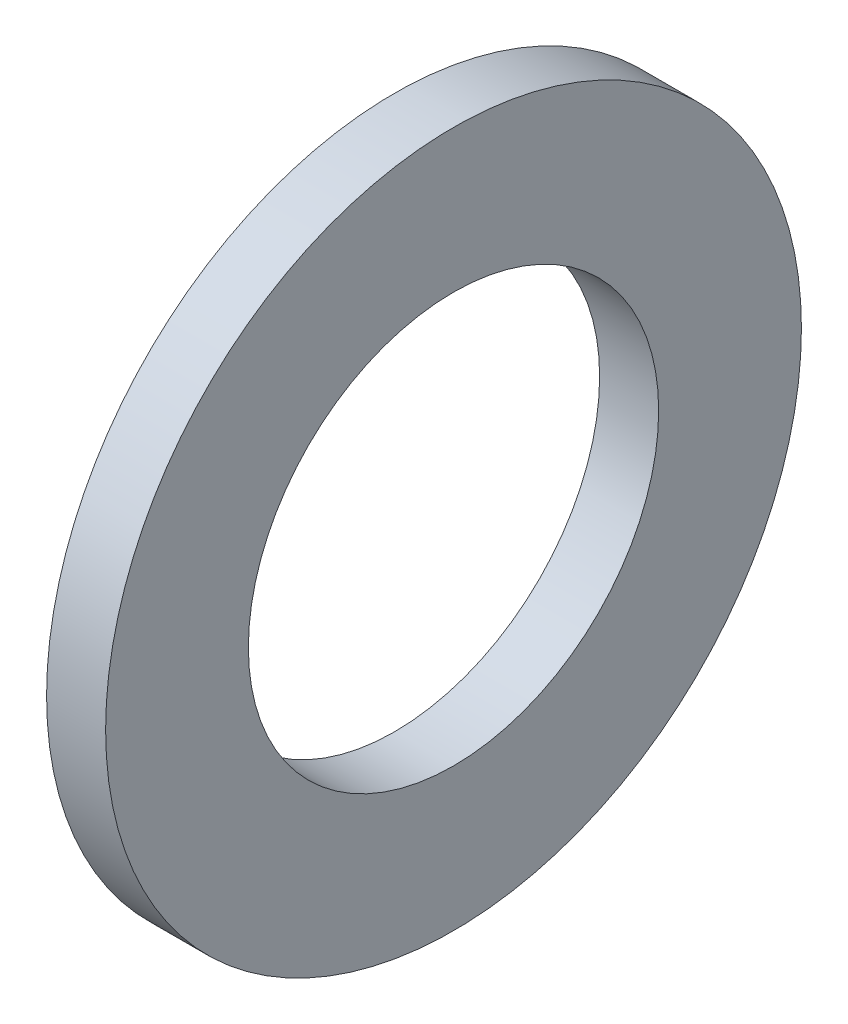
ISO-10303-21;
HEADER;
FILE_DESCRIPTION(('STEP AP214'),'2;1');
FILE_NAME('part.step','',(''),(''),'','','');
FILE_SCHEMA(('AUTOMOTIVE_DESIGN { 1 0 10303 214 1 1 1 1 }'));
ENDSEC;
DATA;
#1=APPLICATION_CONTEXT('core data for automotive mechanical design processes');
#2=APPLICATION_PROTOCOL_DEFINITION('international standard','automotive_design',2000,#1);
#3=PRODUCT_CONTEXT('',#1,'mechanical');
#4=PRODUCT('Part','Part','',(#3));
#5=PRODUCT_RELATED_PRODUCT_CATEGORY('part','',(#4));
#6=PRODUCT_DEFINITION_FORMATION('','',#4);
#7=PRODUCT_DEFINITION_CONTEXT('part definition',#1,'design');
#8=PRODUCT_DEFINITION('design','',#6,#7);
#9=PRODUCT_DEFINITION_SHAPE('','',#8);
#10=(LENGTH_UNIT() NAMED_UNIT(*) SI_UNIT(.MILLI.,.METRE.));
#11=(NAMED_UNIT(*) PLANE_ANGLE_UNIT() SI_UNIT($,.RADIAN.));
#12=(NAMED_UNIT(*) SI_UNIT($,.STERADIAN.) SOLID_ANGLE_UNIT());
#13=UNCERTAINTY_MEASURE_WITH_UNIT(LENGTH_MEASURE(1.E-05),#10,'distance_accuracy_value','');
#14=(GEOMETRIC_REPRESENTATION_CONTEXT(3) GLOBAL_UNCERTAINTY_ASSIGNED_CONTEXT((#13)) GLOBAL_UNIT_ASSIGNED_CONTEXT((#10,
#11,#12)) REPRESENTATION_CONTEXT('',''));
#15=CARTESIAN_POINT('',(0.,0.,0.));
#16=DIRECTION('',(0.,0.,1.));
#17=DIRECTION('',(1.,0.,0.));
#18=AXIS2_PLACEMENT_3D('',#15,#16,#17);
#19=CARTESIAN_POINT('',(-34.9249999999999,0.,0.));
#20=DIRECTION('',(-1.,0.,0.));
#21=DIRECTION('',(0.,0.,1.));
#22=AXIS2_PLACEMENT_3D('',#19,#20,#21);
#23=CYLINDRICAL_SURFACE('',#22,19.46);
#24=CARTESIAN_POINT('',(0.,0.,0.));
#25=DIRECTION('',(-1.,0.,0.));
#26=DIRECTION('',(0.,0.,1.));
#27=AXIS2_PLACEMENT_3D('',#24,#25,#26);
#28=CIRCLE('',#27,19.46);
#29=CARTESIAN_POINT('',(0.,0.,19.46));
#30=VERTEX_POINT('',#29);
#31=EDGE_CURVE('E10',#30,#30,#28,.T.);
#32=ORIENTED_EDGE('',*,*,#31,.F.);
#33=EDGE_LOOP('',(#32));
#34=FACE_BOUND('',#33,.T.);
#35=CARTESIAN_POINT('',(-5.6,0.,0.));
#36=DIRECTION('',(-1.,0.,0.));
#37=DIRECTION('',(0.,0.,1.));
#38=AXIS2_PLACEMENT_3D('',#35,#36,#37);
#39=CIRCLE('',#38,19.46);
#40=CARTESIAN_POINT('',(-5.6,0.,19.46));
#41=VERTEX_POINT('',#40);
#42=EDGE_CURVE('E44',#41,#41,#39,.T.);
#43=ORIENTED_EDGE('',*,*,#42,.T.);
#44=EDGE_LOOP('',(#43));
#45=FACE_BOUND('',#44,.T.);
#46=ADVANCED_FACE('F30',(#34,#45),#23,.F.);
#47=CARTESIAN_POINT('',(0.,19.46,0.));
#48=DIRECTION('',(-1.,0.,0.));
#49=DIRECTION('',(0.,0.,1.));
#50=AXIS2_PLACEMENT_3D('',#47,#48,#49);
#51=PLANE('',#50);
#52=CARTESIAN_POINT('',(0.,0.,0.));
#53=DIRECTION('',(-1.,0.,0.));
#54=DIRECTION('',(0.,0.,1.));
#55=AXIS2_PLACEMENT_3D('',#52,#53,#54);
#56=CIRCLE('',#55,33.);
#57=CARTESIAN_POINT('',(0.,0.,33.));
#58=VERTEX_POINT('',#57);
#59=EDGE_CURVE('E36',#58,#58,#56,.T.);
#60=ORIENTED_EDGE('',*,*,#59,.F.);
#61=EDGE_LOOP('',(#60));
#62=FACE_BOUND('',#61,.T.);
#63=ORIENTED_EDGE('',*,*,#31,.T.);
#64=EDGE_LOOP('',(#63));
#65=FACE_BOUND('',#64,.T.);
#66=ADVANCED_FACE('F59',(#62,#65),#51,.F.);
#67=CARTESIAN_POINT('',(-34.9249999999999,0.,0.));
#68=DIRECTION('',(-1.,0.,0.));
#69=DIRECTION('',(0.,0.,1.));
#70=AXIS2_PLACEMENT_3D('',#67,#68,#69);
#71=CYLINDRICAL_SURFACE('',#70,33.);
#72=CARTESIAN_POINT('',(-5.6,0.,0.));
#73=DIRECTION('',(-1.,0.,0.));
#74=DIRECTION('',(0.,0.,1.));
#75=AXIS2_PLACEMENT_3D('',#72,#73,#74);
#76=CIRCLE('',#75,33.);
#77=CARTESIAN_POINT('',(-5.6,0.,33.));
#78=VERTEX_POINT('',#77);
#79=EDGE_CURVE('E40',#78,#78,#76,.T.);
#80=ORIENTED_EDGE('',*,*,#79,.F.);
#81=EDGE_LOOP('',(#80));
#82=FACE_BOUND('',#81,.T.);
#83=ORIENTED_EDGE('',*,*,#59,.T.);
#84=EDGE_LOOP('',(#83));
#85=FACE_BOUND('',#84,.T.);
#86=ADVANCED_FACE('F54',(#82,#85),#71,.T.);
#87=CARTESIAN_POINT('',(-5.6,33.,0.));
#88=DIRECTION('',(1.,0.,0.));
#89=DIRECTION('',(0.,0.,-1.));
#90=AXIS2_PLACEMENT_3D('',#87,#88,#89);
#91=PLANE('',#90);
#92=ORIENTED_EDGE('',*,*,#42,.F.);
#93=EDGE_LOOP('',(#92));
#94=FACE_BOUND('',#93,.T.);
#95=ORIENTED_EDGE('',*,*,#79,.T.);
#96=EDGE_LOOP('',(#95));
#97=FACE_BOUND('',#96,.T.);
#98=ADVANCED_FACE('F51',(#94,#97),#91,.F.);
#99=CLOSED_SHELL('',(#46,#66,#86,#98));
#100=MANIFOLD_SOLID_BREP('B2',#99);
#101=ADVANCED_BREP_SHAPE_REPRESENTATION('',(#18,#100),#14);
#102=SHAPE_DEFINITION_REPRESENTATION(#9,#101);
ENDSEC;
END-ISO-10303-21;
